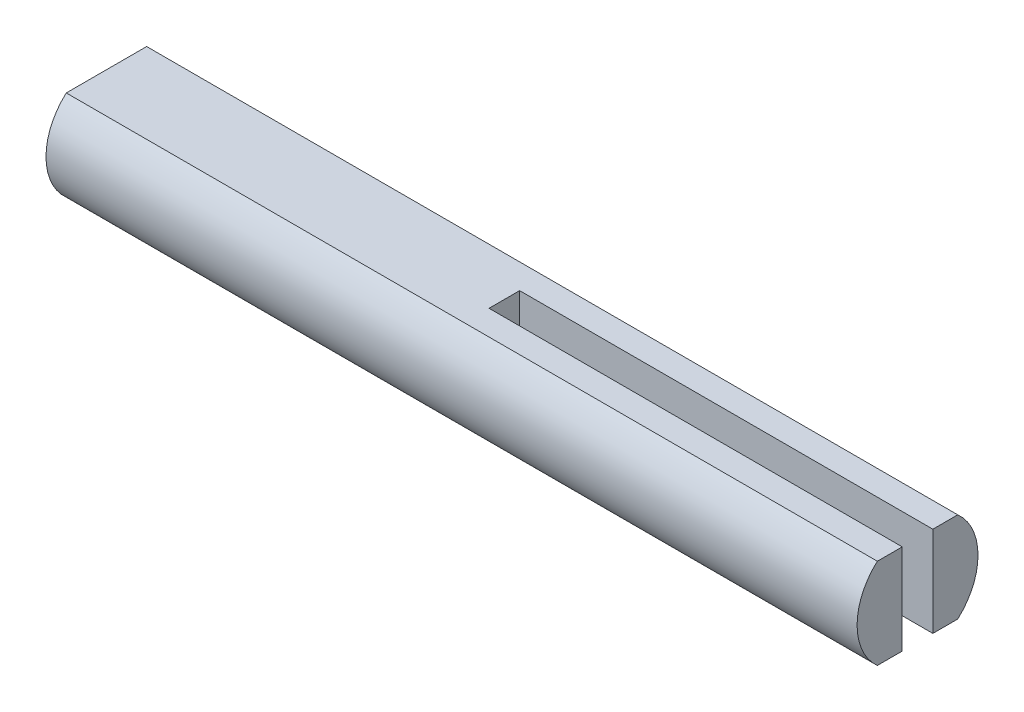
ISO-10303-21;
HEADER;
FILE_DESCRIPTION(('STEP AP214'),'2;1');
FILE_NAME('part.step','',(''),(''),'','','');
FILE_SCHEMA(('AUTOMOTIVE_DESIGN { 1 0 10303 214 1 1 1 1 }'));
ENDSEC;
DATA;
#1=APPLICATION_CONTEXT('core data for automotive mechanical design processes');
#2=APPLICATION_PROTOCOL_DEFINITION('international standard','automotive_design',2000,#1);
#3=PRODUCT_CONTEXT('',#1,'mechanical');
#4=PRODUCT('Part','Part','',(#3));
#5=PRODUCT_RELATED_PRODUCT_CATEGORY('part','',(#4));
#6=PRODUCT_DEFINITION_FORMATION('','',#4);
#7=PRODUCT_DEFINITION_CONTEXT('part definition',#1,'design');
#8=PRODUCT_DEFINITION('design','',#6,#7);
#9=PRODUCT_DEFINITION_SHAPE('','',#8);
#10=(LENGTH_UNIT() NAMED_UNIT(*) SI_UNIT(.MILLI.,.METRE.));
#11=(NAMED_UNIT(*) PLANE_ANGLE_UNIT() SI_UNIT($,.RADIAN.));
#12=(NAMED_UNIT(*) SI_UNIT($,.STERADIAN.) SOLID_ANGLE_UNIT());
#13=UNCERTAINTY_MEASURE_WITH_UNIT(LENGTH_MEASURE(1.E-05),#10,'distance_accuracy_value','');
#14=(GEOMETRIC_REPRESENTATION_CONTEXT(3) GLOBAL_UNCERTAINTY_ASSIGNED_CONTEXT((#13)) GLOBAL_UNIT_ASSIGNED_CONTEXT((#10,
#11,#12)) REPRESENTATION_CONTEXT('',''));
#15=CARTESIAN_POINT('',(0.,0.,0.));
#16=DIRECTION('',(0.,0.,1.));
#17=DIRECTION('',(1.,0.,0.));
#18=AXIS2_PLACEMENT_3D('',#15,#16,#17);
#19=CARTESIAN_POINT('',(40.5,0.,0.));
#20=DIRECTION('',(1.,0.,0.));
#21=DIRECTION('',(0.,0.,-1.));
#22=AXIS2_PLACEMENT_3D('',#19,#20,#21);
#23=PLANE('',#22);
#24=DIRECTION('',(0.,1.,0.));
#25=VECTOR('',#24,1.);
#26=CARTESIAN_POINT('',(40.5,-2.95,1.));
#27=LINE('',#26,#25);
#28=CARTESIAN_POINT('',(40.5,-2.95,1.));
#29=VERTEX_POINT('',#28);
#30=CARTESIAN_POINT('',(40.5,2.95,1.));
#31=VERTEX_POINT('',#30);
#32=EDGE_CURVE('E131',#29,#31,#27,.T.);
#33=ORIENTED_EDGE('',*,*,#32,.T.);
#34=DIRECTION('',(0.,0.,1.));
#35=VECTOR('',#34,1.);
#36=CARTESIAN_POINT('',(40.5,2.95,2.62678510731274));
#37=LINE('',#36,#35);
#38=CARTESIAN_POINT('',(40.5,2.95,2.62678510731274));
#39=VERTEX_POINT('',#38);
#40=EDGE_CURVE('E145',#31,#39,#37,.T.);
#41=ORIENTED_EDGE('',*,*,#40,.T.);
#42=CARTESIAN_POINT('',(40.5,0.,0.));
#43=DIRECTION('',(1.,0.,0.));
#44=DIRECTION('',(0.,0.,-1.));
#45=AXIS2_PLACEMENT_3D('',#42,#43,#44);
#46=CIRCLE('',#45,3.95);
#47=CARTESIAN_POINT('',(40.5,-2.95,2.62678510731274));
#48=VERTEX_POINT('',#47);
#49=EDGE_CURVE('E134',#39,#48,#46,.T.);
#50=ORIENTED_EDGE('',*,*,#49,.T.);
#51=DIRECTION('',(0.,0.,-1.));
#52=VECTOR('',#51,1.);
#53=CARTESIAN_POINT('',(40.5,-2.95,2.62678510731274));
#54=LINE('',#53,#52);
#55=EDGE_CURVE('E139',#48,#29,#54,.T.);
#56=ORIENTED_EDGE('',*,*,#55,.T.);
#57=EDGE_LOOP('',(#33,#41,#50,#56));
#58=FACE_BOUND('',#57,.T.);
#59=ADVANCED_FACE('F35',(#58),#23,.T.);
#60=CARTESIAN_POINT('',(-12.5,0.,0.));
#61=DIRECTION('',(1.,0.,0.));
#62=DIRECTION('',(0.,0.,-1.));
#63=AXIS2_PLACEMENT_3D('',#60,#61,#62);
#64=CYLINDRICAL_SURFACE('',#63,3.95);
#65=DIRECTION('',(1.,0.,0.));
#66=VECTOR('',#65,1.);
#67=CARTESIAN_POINT('',(-12.5,-2.95,2.62678510731274));
#68=LINE('',#67,#66);
#69=CARTESIAN_POINT('',(-12.5,-2.95,2.62678510731274));
#70=VERTEX_POINT('',#69);
#71=EDGE_CURVE('E39',#70,#48,#68,.T.);
#72=ORIENTED_EDGE('',*,*,#71,.T.);
#73=ORIENTED_EDGE('',*,*,#49,.F.);
#74=DIRECTION('',(1.,0.,0.));
#75=VECTOR('',#74,1.);
#76=CARTESIAN_POINT('',(-12.5,2.95,2.62678510731274));
#77=LINE('',#76,#75);
#78=CARTESIAN_POINT('',(-12.5,2.95,2.62678510731274));
#79=VERTEX_POINT('',#78);
#80=EDGE_CURVE('E11',#79,#39,#77,.T.);
#81=ORIENTED_EDGE('',*,*,#80,.F.);
#82=CARTESIAN_POINT('',(-12.5,0.,0.));
#83=DIRECTION('',(1.,0.,0.));
#84=DIRECTION('',(0.,0.,-1.));
#85=AXIS2_PLACEMENT_3D('',#82,#83,#84);
#86=CIRCLE('',#85,3.95);
#87=EDGE_CURVE('E149',#79,#70,#86,.T.);
#88=ORIENTED_EDGE('',*,*,#87,.T.);
#89=EDGE_LOOP('',(#72,#73,#81,#88));
#90=FACE_BOUND('',#89,.T.);
#91=ADVANCED_FACE('F37',(#90),#64,.T.);
#92=CARTESIAN_POINT('',(-12.5,2.95,2.62678510731274));
#93=DIRECTION('',(0.,1.,0.));
#94=DIRECTION('',(0.,0.,1.));
#95=AXIS2_PLACEMENT_3D('',#92,#93,#94);
#96=PLANE('',#95);
#97=DIRECTION('',(1.,0.,0.));
#98=VECTOR('',#97,1.);
#99=CARTESIAN_POINT('',(13.5,2.95,1.));
#100=LINE('',#99,#98);
#101=CARTESIAN_POINT('',(13.5,2.95,1.));
#102=VERTEX_POINT('',#101);
#103=EDGE_CURVE('E123',#102,#31,#100,.T.);
#104=ORIENTED_EDGE('',*,*,#103,.F.);
#105=DIRECTION('',(0.,0.,1.));
#106=VECTOR('',#105,1.);
#107=CARTESIAN_POINT('',(13.5,2.95,1.));
#108=LINE('',#107,#106);
#109=CARTESIAN_POINT('',(13.5,2.95,-0.999999999999997));
#110=VERTEX_POINT('',#109);
#111=EDGE_CURVE('E125',#110,#102,#108,.T.);
#112=ORIENTED_EDGE('',*,*,#111,.F.);
#113=DIRECTION('',(-1.,0.,0.));
#114=VECTOR('',#113,1.);
#115=CARTESIAN_POINT('',(40.5,2.95,-1.));
#116=LINE('',#115,#114);
#117=CARTESIAN_POINT('',(40.5,2.95,-1.));
#118=VERTEX_POINT('',#117);
#119=EDGE_CURVE('E104',#118,#110,#116,.T.);
#120=ORIENTED_EDGE('',*,*,#119,.F.);
#121=CARTESIAN_POINT('',(40.5,2.95,-2.62678510731274));
#122=VERTEX_POINT('',#121);
#123=EDGE_CURVE('E146',#122,#118,#37,.T.);
#124=ORIENTED_EDGE('',*,*,#123,.F.);
#125=DIRECTION('',(1.,0.,0.));
#126=VECTOR('',#125,1.);
#127=CARTESIAN_POINT('',(-12.5,2.95,-2.62678510731274));
#128=LINE('',#127,#126);
#129=CARTESIAN_POINT('',(-12.5,2.95,-2.62678510731274));
#130=VERTEX_POINT('',#129);
#131=EDGE_CURVE('E44',#130,#122,#128,.T.);
#132=ORIENTED_EDGE('',*,*,#131,.F.);
#133=DIRECTION('',(0.,0.,1.));
#134=VECTOR('',#133,1.);
#135=CARTESIAN_POINT('',(-12.5,2.95,2.62678510731274));
#136=LINE('',#135,#134);
#137=EDGE_CURVE('E157',#130,#79,#136,.T.);
#138=ORIENTED_EDGE('',*,*,#137,.T.);
#139=ORIENTED_EDGE('',*,*,#80,.T.);
#140=ORIENTED_EDGE('',*,*,#40,.F.);
#141=EDGE_LOOP('',(#104,#112,#120,#124,#132,#138,#139,#140));
#142=FACE_BOUND('',#141,.T.);
#143=ADVANCED_FACE('F168',(#142),#96,.T.);
#144=CARTESIAN_POINT('',(-12.5,0.,0.));
#145=DIRECTION('',(1.,0.,0.));
#146=DIRECTION('',(0.,0.,-1.));
#147=AXIS2_PLACEMENT_3D('',#144,#145,#146);
#148=CYLINDRICAL_SURFACE('',#147,3.95);
#149=ORIENTED_EDGE('',*,*,#131,.T.);
#150=CARTESIAN_POINT('',(40.5,0.,0.));
#151=DIRECTION('',(1.,0.,0.));
#152=DIRECTION('',(0.,0.,-1.));
#153=AXIS2_PLACEMENT_3D('',#150,#151,#152);
#154=CIRCLE('',#153,3.95);
#155=CARTESIAN_POINT('',(40.5,-2.95,-2.62678510731274));
#156=VERTEX_POINT('',#155);
#157=EDGE_CURVE('E142',#156,#122,#154,.T.);
#158=ORIENTED_EDGE('',*,*,#157,.F.);
#159=DIRECTION('',(1.,0.,0.));
#160=VECTOR('',#159,1.);
#161=CARTESIAN_POINT('',(-12.5,-2.95,-2.62678510731274));
#162=LINE('',#161,#160);
#163=CARTESIAN_POINT('',(-12.5,-2.95,-2.62678510731274));
#164=VERTEX_POINT('',#163);
#165=EDGE_CURVE('E160',#164,#156,#162,.T.);
#166=ORIENTED_EDGE('',*,*,#165,.F.);
#167=CARTESIAN_POINT('',(-12.5,0.,0.));
#168=DIRECTION('',(1.,0.,0.));
#169=DIRECTION('',(0.,0.,-1.));
#170=AXIS2_PLACEMENT_3D('',#167,#168,#169);
#171=CIRCLE('',#170,3.95);
#172=EDGE_CURVE('E154',#164,#130,#171,.T.);
#173=ORIENTED_EDGE('',*,*,#172,.T.);
#174=EDGE_LOOP('',(#149,#158,#166,#173));
#175=FACE_BOUND('',#174,.T.);
#176=ADVANCED_FACE('F175',(#175),#148,.T.);
#177=CARTESIAN_POINT('',(-12.5,-2.95,2.62678510731274));
#178=DIRECTION('',(0.,-1.,0.));
#179=DIRECTION('',(0.,0.,-1.));
#180=AXIS2_PLACEMENT_3D('',#177,#178,#179);
#181=PLANE('',#180);
#182=DIRECTION('',(1.,0.,0.));
#183=VECTOR('',#182,1.);
#184=CARTESIAN_POINT('',(13.5,-2.95,1.));
#185=LINE('',#184,#183);
#186=CARTESIAN_POINT('',(13.5,-2.95,1.));
#187=VERTEX_POINT('',#186);
#188=EDGE_CURVE('E117',#187,#29,#185,.T.);
#189=ORIENTED_EDGE('',*,*,#188,.T.);
#190=ORIENTED_EDGE('',*,*,#55,.F.);
#191=ORIENTED_EDGE('',*,*,#71,.F.);
#192=DIRECTION('',(0.,0.,-1.));
#193=VECTOR('',#192,1.);
#194=CARTESIAN_POINT('',(-12.5,-2.95,2.62678510731274));
#195=LINE('',#194,#193);
#196=EDGE_CURVE('E151',#70,#164,#195,.T.);
#197=ORIENTED_EDGE('',*,*,#196,.T.);
#198=ORIENTED_EDGE('',*,*,#165,.T.);
#199=CARTESIAN_POINT('',(40.5,-2.95,-1.));
#200=VERTEX_POINT('',#199);
#201=EDGE_CURVE('E122',#200,#156,#54,.T.);
#202=ORIENTED_EDGE('',*,*,#201,.F.);
#203=DIRECTION('',(-1.,0.,0.));
#204=VECTOR('',#203,1.);
#205=CARTESIAN_POINT('',(40.5,-2.95,-1.));
#206=LINE('',#205,#204);
#207=CARTESIAN_POINT('',(13.5,-2.95,-0.999999999999997));
#208=VERTEX_POINT('',#207);
#209=EDGE_CURVE('E52',#200,#208,#206,.T.);
#210=ORIENTED_EDGE('',*,*,#209,.T.);
#211=DIRECTION('',(0.,0.,1.));
#212=VECTOR('',#211,1.);
#213=CARTESIAN_POINT('',(13.5,-2.95,1.));
#214=LINE('',#213,#212);
#215=EDGE_CURVE('E112',#208,#187,#214,.T.);
#216=ORIENTED_EDGE('',*,*,#215,.T.);
#217=EDGE_LOOP('',(#189,#190,#191,#197,#198,#202,#210,#216));
#218=FACE_BOUND('',#217,.T.);
#219=ADVANCED_FACE('F120',(#218),#181,.T.);
#220=CARTESIAN_POINT('',(-12.5,0.,0.));
#221=DIRECTION('',(1.,0.,0.));
#222=DIRECTION('',(0.,0.,-1.));
#223=AXIS2_PLACEMENT_3D('',#220,#221,#222);
#224=PLANE('',#223);
#225=ORIENTED_EDGE('',*,*,#87,.F.);
#226=ORIENTED_EDGE('',*,*,#137,.F.);
#227=ORIENTED_EDGE('',*,*,#172,.F.);
#228=ORIENTED_EDGE('',*,*,#196,.F.);
#229=EDGE_LOOP('',(#225,#226,#227,#228));
#230=FACE_BOUND('',#229,.T.);
#231=ADVANCED_FACE('F173',(#230),#224,.F.);
#232=DIRECTION('',(0.,1.,0.));
#233=VECTOR('',#232,1.);
#234=CARTESIAN_POINT('',(40.5,-2.95,-1.));
#235=LINE('',#234,#233);
#236=EDGE_CURVE('E109',#200,#118,#235,.T.);
#237=ORIENTED_EDGE('',*,*,#236,.F.);
#238=ORIENTED_EDGE('',*,*,#201,.T.);
#239=ORIENTED_EDGE('',*,*,#157,.T.);
#240=ORIENTED_EDGE('',*,*,#123,.T.);
#241=EDGE_LOOP('',(#237,#238,#239,#240));
#242=FACE_BOUND('',#241,.T.);
#243=ADVANCED_FACE('F177',(#242),#23,.T.);
#244=CARTESIAN_POINT('',(13.5,-2.95,1.));
#245=DIRECTION('',(0.,0.,1.));
#246=DIRECTION('',(1.,0.,0.));
#247=AXIS2_PLACEMENT_3D('',#244,#245,#246);
#248=PLANE('',#247);
#249=ORIENTED_EDGE('',*,*,#103,.T.);
#250=ORIENTED_EDGE('',*,*,#32,.F.);
#251=ORIENTED_EDGE('',*,*,#188,.F.);
#252=DIRECTION('',(0.,1.,0.));
#253=VECTOR('',#252,1.);
#254=CARTESIAN_POINT('',(13.5,-2.95,1.));
#255=LINE('',#254,#253);
#256=EDGE_CURVE('E108',#187,#102,#255,.T.);
#257=ORIENTED_EDGE('',*,*,#256,.T.);
#258=EDGE_LOOP('',(#249,#250,#251,#257));
#259=FACE_BOUND('',#258,.T.);
#260=ADVANCED_FACE('F179',(#259),#248,.F.);
#261=CARTESIAN_POINT('',(13.5,-2.95,1.));
#262=DIRECTION('',(-1.,0.,0.));
#263=DIRECTION('',(0.,0.,1.));
#264=AXIS2_PLACEMENT_3D('',#261,#262,#263);
#265=PLANE('',#264);
#266=ORIENTED_EDGE('',*,*,#111,.T.);
#267=ORIENTED_EDGE('',*,*,#256,.F.);
#268=ORIENTED_EDGE('',*,*,#215,.F.);
#269=DIRECTION('',(0.,1.,0.));
#270=VECTOR('',#269,1.);
#271=CARTESIAN_POINT('',(13.5,-2.95,-0.999999999999997));
#272=LINE('',#271,#270);
#273=EDGE_CURVE('E100',#208,#110,#272,.T.);
#274=ORIENTED_EDGE('',*,*,#273,.T.);
#275=EDGE_LOOP('',(#266,#267,#268,#274));
#276=FACE_BOUND('',#275,.T.);
#277=ADVANCED_FACE('F113',(#276),#265,.F.);
#278=CARTESIAN_POINT('',(40.5,-2.95,-1.));
#279=DIRECTION('',(0.,0.,-1.));
#280=DIRECTION('',(-1.,0.,0.));
#281=AXIS2_PLACEMENT_3D('',#278,#279,#280);
#282=PLANE('',#281);
#283=ORIENTED_EDGE('',*,*,#119,.T.);
#284=ORIENTED_EDGE('',*,*,#273,.F.);
#285=ORIENTED_EDGE('',*,*,#209,.F.);
#286=ORIENTED_EDGE('',*,*,#236,.T.);
#287=EDGE_LOOP('',(#283,#284,#285,#286));
#288=FACE_BOUND('',#287,.T.);
#289=ADVANCED_FACE('F102',(#288),#282,.F.);
#290=CLOSED_SHELL('',(#59,#91,#143,#176,#219,#231,#243,#260,#277,#289));
#291=MANIFOLD_SOLID_BREP('B2',#290);
#292=ADVANCED_BREP_SHAPE_REPRESENTATION('',(#18,#291),#14);
#293=SHAPE_DEFINITION_REPRESENTATION(#9,#292);
ENDSEC;
END-ISO-10303-21;
